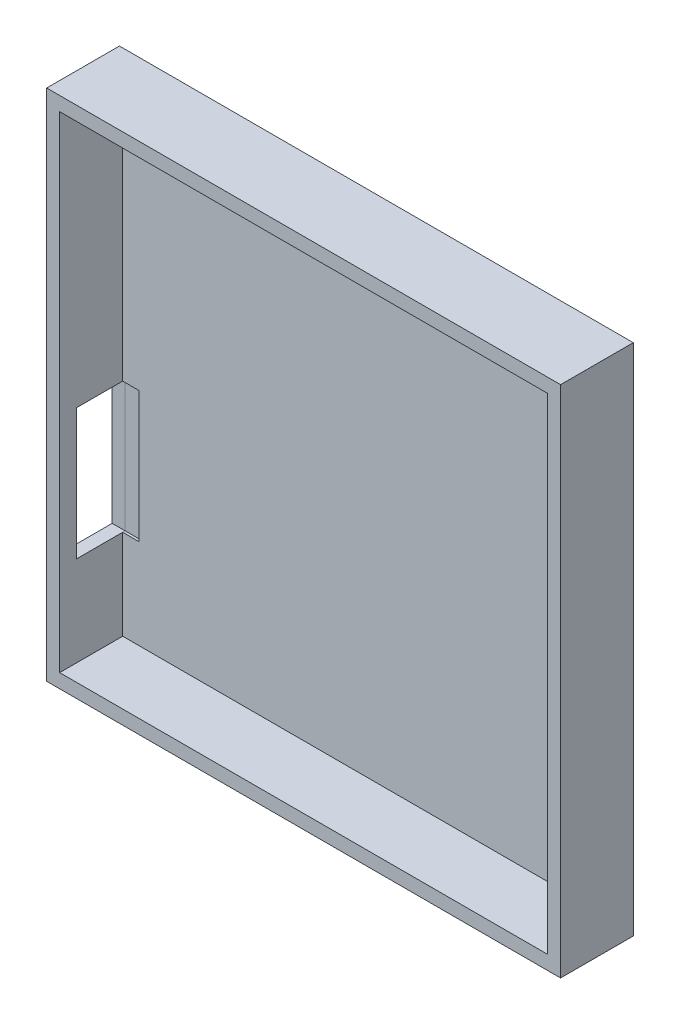
ISO-10303-21;
HEADER;
FILE_DESCRIPTION(('STEP AP214'),'2;1');
FILE_NAME('part.step','',(''),(''),'','','');
FILE_SCHEMA(('AUTOMOTIVE_DESIGN { 1 0 10303 214 1 1 1 1 }'));
ENDSEC;
DATA;
#1=APPLICATION_CONTEXT('core data for automotive mechanical design processes');
#2=APPLICATION_PROTOCOL_DEFINITION('international standard','automotive_design',2000,#1);
#3=PRODUCT_CONTEXT('',#1,'mechanical');
#4=PRODUCT('Part','Part','',(#3));
#5=PRODUCT_RELATED_PRODUCT_CATEGORY('part','',(#4));
#6=PRODUCT_DEFINITION_FORMATION('','',#4);
#7=PRODUCT_DEFINITION_CONTEXT('part definition',#1,'design');
#8=PRODUCT_DEFINITION('design','',#6,#7);
#9=PRODUCT_DEFINITION_SHAPE('','',#8);
#10=(LENGTH_UNIT() NAMED_UNIT(*) SI_UNIT(.MILLI.,.METRE.));
#11=(NAMED_UNIT(*) PLANE_ANGLE_UNIT() SI_UNIT($,.RADIAN.));
#12=(NAMED_UNIT(*) SI_UNIT($,.STERADIAN.) SOLID_ANGLE_UNIT());
#13=UNCERTAINTY_MEASURE_WITH_UNIT(LENGTH_MEASURE(1.E-05),#10,'distance_accuracy_value','');
#14=(GEOMETRIC_REPRESENTATION_CONTEXT(3) GLOBAL_UNCERTAINTY_ASSIGNED_CONTEXT((#13)) GLOBAL_UNIT_ASSIGNED_CONTEXT((#10,
#11,#12)) REPRESENTATION_CONTEXT('',''));
#15=CARTESIAN_POINT('',(0.,0.,0.));
#16=DIRECTION('',(0.,0.,1.));
#17=DIRECTION('',(1.,0.,0.));
#18=AXIS2_PLACEMENT_3D('',#15,#16,#17);
#19=CARTESIAN_POINT('',(100.674181587413,-143.86005830323,2.));
#20=DIRECTION('',(-1.,0.,0.));
#21=DIRECTION('',(0.,0.,1.));
#22=AXIS2_PLACEMENT_3D('',#19,#20,#21);
#23=PLANE('',#22);
#24=DIRECTION('',(0.,0.,1.));
#25=VECTOR('',#24,1.);
#26=CARTESIAN_POINT('',(100.674181587413,-125.279102377652,2.));
#27=LINE('',#26,#25);
#28=CARTESIAN_POINT('',(100.674181587413,-125.279102377652,1.5));
#29=VERTEX_POINT('',#28);
#30=CARTESIAN_POINT('',(100.674181587413,-125.279102377652,2.));
#31=VERTEX_POINT('',#30);
#32=EDGE_CURVE('E150',#29,#31,#27,.T.);
#33=ORIENTED_EDGE('',*,*,#32,.F.);
#34=DIRECTION('',(0.,-1.,0.));
#35=VECTOR('',#34,1.);
#36=CARTESIAN_POINT('',(100.674181587413,-143.86005830323,1.50000000000001));
#37=LINE('',#36,#35);
#38=CARTESIAN_POINT('',(100.674181587413,-98.2791023776523,1.5));
#39=VERTEX_POINT('',#38);
#40=EDGE_CURVE('E12',#39,#29,#37,.T.);
#41=ORIENTED_EDGE('',*,*,#40,.F.);
#42=DIRECTION('',(0.,0.,1.));
#43=VECTOR('',#42,1.);
#44=CARTESIAN_POINT('',(100.674181587413,-98.2791023776523,2.));
#45=LINE('',#44,#43);
#46=CARTESIAN_POINT('',(100.674181587413,-98.2791023776523,2.));
#47=VERTEX_POINT('',#46);
#48=EDGE_CURVE('E127',#39,#47,#45,.T.);
#49=ORIENTED_EDGE('',*,*,#48,.T.);
#50=DIRECTION('',(0.,1.,0.));
#51=VECTOR('',#50,1.);
#52=CARTESIAN_POINT('',(100.674181587413,-143.86005830323,2.));
#53=LINE('',#52,#51);
#54=CARTESIAN_POINT('',(100.674181587413,-43.6399416967701,2.));
#55=VERTEX_POINT('',#54);
#56=EDGE_CURVE('E98',#47,#55,#53,.T.);
#57=ORIENTED_EDGE('',*,*,#56,.T.);
#58=DIRECTION('',(0.,0.,-1.));
#59=VECTOR('',#58,1.);
#60=CARTESIAN_POINT('',(100.674181587413,-43.6399416967701,2.));
#61=LINE('',#60,#59);
#62=CARTESIAN_POINT('',(100.674181587413,-43.6399416967701,0.));
#63=VERTEX_POINT('',#62);
#64=EDGE_CURVE('E167',#55,#63,#61,.T.);
#65=ORIENTED_EDGE('',*,*,#64,.T.);
#66=DIRECTION('',(0.,1.,0.));
#67=VECTOR('',#66,1.);
#68=CARTESIAN_POINT('',(100.674181587413,-143.86005830323,0.));
#69=LINE('',#68,#67);
#70=CARTESIAN_POINT('',(100.674181587413,-143.86005830323,0.));
#71=VERTEX_POINT('',#70);
#72=EDGE_CURVE('E153',#71,#63,#69,.T.);
#73=ORIENTED_EDGE('',*,*,#72,.F.);
#74=DIRECTION('',(0.,0.,-1.));
#75=VECTOR('',#74,1.);
#76=CARTESIAN_POINT('',(100.674181587413,-143.86005830323,2.));
#77=LINE('',#76,#75);
#78=CARTESIAN_POINT('',(100.674181587413,-143.86005830323,2.));
#79=VERTEX_POINT('',#78);
#80=EDGE_CURVE('E74',#79,#71,#77,.T.);
#81=ORIENTED_EDGE('',*,*,#80,.F.);
#82=EDGE_CURVE('E154',#79,#31,#53,.T.);
#83=ORIENTED_EDGE('',*,*,#82,.T.);
#84=EDGE_LOOP('',(#33,#41,#49,#57,#65,#73,#81,#83));
#85=FACE_BOUND('',#84,.T.);
#86=ADVANCED_FACE('F50',(#85),#23,.T.);
#87=CARTESIAN_POINT('',(100.674181587413,-143.86005830323,2.));
#88=DIRECTION('',(0.,1.,0.));
#89=DIRECTION('',(0.,0.,1.));
#90=AXIS2_PLACEMENT_3D('',#87,#88,#89);
#91=PLANE('',#90);
#92=DIRECTION('',(1.,0.,0.));
#93=VECTOR('',#92,1.);
#94=CARTESIAN_POINT('',(100.674181587413,-143.86005830323,0.));
#95=LINE('',#94,#93);
#96=CARTESIAN_POINT('',(201.333218412587,-143.86005830323,0.));
#97=VERTEX_POINT('',#96);
#98=EDGE_CURVE('E179',#71,#97,#95,.T.);
#99=ORIENTED_EDGE('',*,*,#98,.T.);
#100=DIRECTION('',(0.,0.,-1.));
#101=VECTOR('',#100,1.);
#102=CARTESIAN_POINT('',(201.333218412587,-143.86005830323,2.));
#103=LINE('',#102,#101);
#104=CARTESIAN_POINT('',(201.333218412587,-143.86005830323,2.));
#105=VERTEX_POINT('',#104);
#106=EDGE_CURVE('E184',#105,#97,#103,.T.);
#107=ORIENTED_EDGE('',*,*,#106,.F.);
#108=DIRECTION('',(1.,0.,0.));
#109=VECTOR('',#108,1.);
#110=CARTESIAN_POINT('',(100.674181587413,-143.86005830323,2.));
#111=LINE('',#110,#109);
#112=EDGE_CURVE('E164',#79,#105,#111,.T.);
#113=ORIENTED_EDGE('',*,*,#112,.F.);
#114=ORIENTED_EDGE('',*,*,#80,.T.);
#115=EDGE_LOOP('',(#99,#107,#113,#114));
#116=FACE_BOUND('',#115,.T.);
#117=ADVANCED_FACE('F218',(#116),#91,.F.);
#118=CARTESIAN_POINT('',(201.333218412587,-143.86005830323,2.));
#119=DIRECTION('',(-1.,0.,0.));
#120=DIRECTION('',(0.,0.,1.));
#121=AXIS2_PLACEMENT_3D('',#118,#119,#120);
#122=PLANE('',#121);
#123=DIRECTION('',(0.,1.,0.));
#124=VECTOR('',#123,1.);
#125=CARTESIAN_POINT('',(201.333218412587,-143.86005830323,0.));
#126=LINE('',#125,#124);
#127=CARTESIAN_POINT('',(201.333218412587,-43.6399416967701,0.));
#128=VERTEX_POINT('',#127);
#129=EDGE_CURVE('E175',#97,#128,#126,.T.);
#130=ORIENTED_EDGE('',*,*,#129,.T.);
#131=DIRECTION('',(0.,0.,-1.));
#132=VECTOR('',#131,1.);
#133=CARTESIAN_POINT('',(201.333218412587,-43.6399416967701,2.));
#134=LINE('',#133,#132);
#135=CARTESIAN_POINT('',(201.333218412587,-43.6399416967701,2.));
#136=VERTEX_POINT('',#135);
#137=EDGE_CURVE('E188',#136,#128,#134,.T.);
#138=ORIENTED_EDGE('',*,*,#137,.F.);
#139=DIRECTION('',(0.,1.,0.));
#140=VECTOR('',#139,1.);
#141=CARTESIAN_POINT('',(201.333218412587,-143.86005830323,2.));
#142=LINE('',#141,#140);
#143=EDGE_CURVE('E161',#105,#136,#142,.T.);
#144=ORIENTED_EDGE('',*,*,#143,.F.);
#145=ORIENTED_EDGE('',*,*,#106,.T.);
#146=EDGE_LOOP('',(#130,#138,#144,#145));
#147=FACE_BOUND('',#146,.T.);
#148=ADVANCED_FACE('F224',(#147),#122,.F.);
#149=CARTESIAN_POINT('',(100.674181587413,-43.6399416967701,2.));
#150=DIRECTION('',(0.,1.,0.));
#151=DIRECTION('',(0.,0.,1.));
#152=AXIS2_PLACEMENT_3D('',#149,#150,#151);
#153=PLANE('',#152);
#154=DIRECTION('',(1.,0.,0.));
#155=VECTOR('',#154,1.);
#156=CARTESIAN_POINT('',(100.674181587413,-43.6399416967701,0.));
#157=LINE('',#156,#155);
#158=EDGE_CURVE('E171',#63,#128,#157,.T.);
#159=ORIENTED_EDGE('',*,*,#158,.F.);
#160=ORIENTED_EDGE('',*,*,#64,.F.);
#161=DIRECTION('',(1.,0.,0.));
#162=VECTOR('',#161,1.);
#163=CARTESIAN_POINT('',(100.674181587413,-43.6399416967701,2.));
#164=LINE('',#163,#162);
#165=EDGE_CURVE('E157',#55,#136,#164,.T.);
#166=ORIENTED_EDGE('',*,*,#165,.T.);
#167=ORIENTED_EDGE('',*,*,#137,.T.);
#168=EDGE_LOOP('',(#159,#160,#166,#167));
#169=FACE_BOUND('',#168,.T.);
#170=ADVANCED_FACE('F229',(#169),#153,.T.);
#171=CARTESIAN_POINT('',(0.,0.,2.));
#172=DIRECTION('',(0.,0.,-1.));
#173=DIRECTION('',(-1.,0.,0.));
#174=AXIS2_PLACEMENT_3D('',#171,#172,#173);
#175=PLANE('',#174);
#176=DIRECTION('',(0.,-1.,0.));
#177=VECTOR('',#176,1.);
#178=CARTESIAN_POINT('',(104.0037,0.,2.));
#179=LINE('',#178,#177);
#180=CARTESIAN_POINT('',(104.0037,-98.2791023776523,2.));
#181=VERTEX_POINT('',#180);
#182=CARTESIAN_POINT('',(104.0037,-125.279102377652,2.));
#183=VERTEX_POINT('',#182);
#184=EDGE_CURVE('E137',#181,#183,#179,.T.);
#185=ORIENTED_EDGE('',*,*,#184,.T.);
#186=DIRECTION('',(-1.,0.,0.));
#187=VECTOR('',#186,1.);
#188=CARTESIAN_POINT('',(0.,-125.279102377652,2.));
#189=LINE('',#188,#187);
#190=EDGE_CURVE('E58',#183,#31,#189,.T.);
#191=ORIENTED_EDGE('',*,*,#190,.T.);
#192=ORIENTED_EDGE('',*,*,#82,.F.);
#193=ORIENTED_EDGE('',*,*,#112,.T.);
#194=ORIENTED_EDGE('',*,*,#143,.T.);
#195=ORIENTED_EDGE('',*,*,#165,.F.);
#196=ORIENTED_EDGE('',*,*,#56,.F.);
#197=DIRECTION('',(-1.,0.,0.));
#198=VECTOR('',#197,1.);
#199=CARTESIAN_POINT('',(0.,-98.2791023776523,2.));
#200=LINE('',#199,#198);
#201=EDGE_CURVE('E195',#181,#47,#200,.T.);
#202=ORIENTED_EDGE('',*,*,#201,.F.);
#203=EDGE_LOOP('',(#185,#191,#192,#193,#194,#195,#196,#202));
#204=FACE_BOUND('',#203,.T.);
#205=ADVANCED_FACE('F201',(#204),#175,.F.);
#206=CARTESIAN_POINT('',(0.,0.,0.));
#207=DIRECTION('',(0.,0.,-1.));
#208=DIRECTION('',(-1.,0.,0.));
#209=AXIS2_PLACEMENT_3D('',#206,#207,#208);
#210=PLANE('',#209);
#211=ORIENTED_EDGE('',*,*,#72,.T.);
#212=ORIENTED_EDGE('',*,*,#158,.T.);
#213=ORIENTED_EDGE('',*,*,#129,.F.);
#214=ORIENTED_EDGE('',*,*,#98,.F.);
#215=EDGE_LOOP('',(#211,#212,#213,#214));
#216=FACE_BOUND('',#215,.T.);
#217=ADVANCED_FACE('F213',(#216),#210,.T.);
#218=CARTESIAN_POINT('',(104.0037,0.,0.));
#219=DIRECTION('',(1.,0.,0.));
#220=DIRECTION('',(0.,0.,-1.));
#221=AXIS2_PLACEMENT_3D('',#218,#219,#220);
#222=PLANE('',#221);
#223=DIRECTION('',(0.,0.,1.));
#224=VECTOR('',#223,1.);
#225=CARTESIAN_POINT('',(104.0037,-98.2791023776523,1.5));
#226=LINE('',#225,#224);
#227=CARTESIAN_POINT('',(104.0037,-98.2791023776523,1.5));
#228=VERTEX_POINT('',#227);
#229=EDGE_CURVE('E125',#228,#181,#226,.T.);
#230=ORIENTED_EDGE('',*,*,#229,.F.);
#231=DIRECTION('',(0.,-1.,0.));
#232=VECTOR('',#231,1.);
#233=CARTESIAN_POINT('',(104.0037,-98.2791023776523,1.5));
#234=LINE('',#233,#232);
#235=CARTESIAN_POINT('',(104.0037,-125.279102377652,1.5));
#236=VERTEX_POINT('',#235);
#237=EDGE_CURVE('E133',#228,#236,#234,.T.);
#238=ORIENTED_EDGE('',*,*,#237,.T.);
#239=DIRECTION('',(0.,0.,1.));
#240=VECTOR('',#239,1.);
#241=CARTESIAN_POINT('',(104.0037,-125.279102377652,1.5));
#242=LINE('',#241,#240);
#243=EDGE_CURVE('E65',#236,#183,#242,.T.);
#244=ORIENTED_EDGE('',*,*,#243,.T.);
#245=ORIENTED_EDGE('',*,*,#184,.F.);
#246=EDGE_LOOP('',(#230,#238,#244,#245));
#247=FACE_BOUND('',#246,.T.);
#248=ADVANCED_FACE('F135',(#247),#222,.F.);
#249=CARTESIAN_POINT('',(104.0037,-125.279102377652,1.5));
#250=DIRECTION('',(0.,-1.,0.));
#251=DIRECTION('',(0.,0.,-1.));
#252=AXIS2_PLACEMENT_3D('',#249,#250,#251);
#253=PLANE('',#252);
#254=ORIENTED_EDGE('',*,*,#32,.T.);
#255=ORIENTED_EDGE('',*,*,#190,.F.);
#256=ORIENTED_EDGE('',*,*,#243,.F.);
#257=DIRECTION('',(-1.,0.,0.));
#258=VECTOR('',#257,1.);
#259=CARTESIAN_POINT('',(104.0037,-125.279102377652,1.5));
#260=LINE('',#259,#258);
#261=EDGE_CURVE('E132',#236,#29,#260,.T.);
#262=ORIENTED_EDGE('',*,*,#261,.T.);
#263=EDGE_LOOP('',(#254,#255,#256,#262));
#264=FACE_BOUND('',#263,.T.);
#265=ADVANCED_FACE('F204',(#264),#253,.F.);
#266=CARTESIAN_POINT('',(104.0037,-98.2791023776523,1.5));
#267=DIRECTION('',(0.,0.,-1.));
#268=DIRECTION('',(0.,1.,0.));
#269=AXIS2_PLACEMENT_3D('',#266,#267,#268);
#270=PLANE('',#269);
#271=ORIENTED_EDGE('',*,*,#40,.T.);
#272=ORIENTED_EDGE('',*,*,#261,.F.);
#273=ORIENTED_EDGE('',*,*,#237,.F.);
#274=DIRECTION('',(-1.,0.,0.));
#275=VECTOR('',#274,1.);
#276=CARTESIAN_POINT('',(104.0037,-98.2791023776523,1.5));
#277=LINE('',#276,#275);
#278=EDGE_CURVE('E122',#228,#39,#277,.T.);
#279=ORIENTED_EDGE('',*,*,#278,.T.);
#280=EDGE_LOOP('',(#271,#272,#273,#279));
#281=FACE_BOUND('',#280,.T.);
#282=ADVANCED_FACE('F140',(#281),#270,.F.);
#283=CARTESIAN_POINT('',(104.0037,-98.2791023776523,1.5));
#284=DIRECTION('',(0.,-1.,0.));
#285=DIRECTION('',(0.,0.,-1.));
#286=AXIS2_PLACEMENT_3D('',#283,#284,#285);
#287=PLANE('',#286);
#288=ORIENTED_EDGE('',*,*,#278,.F.);
#289=ORIENTED_EDGE('',*,*,#229,.T.);
#290=ORIENTED_EDGE('',*,*,#201,.T.);
#291=ORIENTED_EDGE('',*,*,#48,.F.);
#292=EDGE_LOOP('',(#288,#289,#290,#291));
#293=FACE_BOUND('',#292,.T.);
#294=ADVANCED_FACE('F124',(#293),#287,.T.);
#295=CLOSED_SHELL('',(#86,#117,#148,#170,#205,#217,#248,#265,#282,#294));
#296=MANIFOLD_SOLID_BREP('B2',#295);
#297=CARTESIAN_POINT('',(0.,0.,15.));
#298=DIRECTION('',(0.,0.,-1.));
#299=DIRECTION('',(-1.,0.,0.));
#300=AXIS2_PLACEMENT_3D('',#297,#298,#299);
#301=PLANE('',#300);
#302=DIRECTION('',(0.,-1.,0.));
#303=VECTOR('',#302,1.);
#304=CARTESIAN_POINT('',(98.0037,-146.75,15.));
#305=LINE('',#304,#303);
#306=CARTESIAN_POINT('',(98.0037,-40.75,15.));
#307=VERTEX_POINT('',#306);
#308=CARTESIAN_POINT('',(98.0037,-146.75,15.));
#309=VERTEX_POINT('',#308);
#310=EDGE_CURVE('E448',#307,#309,#305,.T.);
#311=ORIENTED_EDGE('',*,*,#310,.T.);
#312=DIRECTION('',(1.,0.,0.));
#313=VECTOR('',#312,1.);
#314=CARTESIAN_POINT('',(98.0037,-146.75,15.));
#315=LINE('',#314,#313);
#316=CARTESIAN_POINT('',(204.0037,-146.75,15.));
#317=VERTEX_POINT('',#316);
#318=EDGE_CURVE('E451',#309,#317,#315,.T.);
#319=ORIENTED_EDGE('',*,*,#318,.T.);
#320=DIRECTION('',(0.,1.,0.));
#321=VECTOR('',#320,1.);
#322=CARTESIAN_POINT('',(204.0037,-146.75,15.));
#323=LINE('',#322,#321);
#324=CARTESIAN_POINT('',(204.0037,-40.75,15.));
#325=VERTEX_POINT('',#324);
#326=EDGE_CURVE('E454',#317,#325,#323,.T.);
#327=ORIENTED_EDGE('',*,*,#326,.T.);
#328=DIRECTION('',(-1.,0.,0.));
#329=VECTOR('',#328,1.);
#330=CARTESIAN_POINT('',(98.0037,-40.75,15.));
#331=LINE('',#330,#329);
#332=EDGE_CURVE('E456',#325,#307,#331,.T.);
#333=ORIENTED_EDGE('',*,*,#332,.T.);
#334=EDGE_LOOP('',(#311,#319,#327,#333));
#335=FACE_BOUND('',#334,.T.);
#336=DIRECTION('',(-1.,0.,0.));
#337=VECTOR('',#336,1.);
#338=CARTESIAN_POINT('',(100.674181587413,-43.6399416967701,15.));
#339=LINE('',#338,#337);
#340=CARTESIAN_POINT('',(201.333218412587,-43.6399416967701,15.));
#341=VERTEX_POINT('',#340);
#342=CARTESIAN_POINT('',(100.674181587413,-43.6399416967701,15.));
#343=VERTEX_POINT('',#342);
#344=EDGE_CURVE('E417',#341,#343,#339,.T.);
#345=ORIENTED_EDGE('',*,*,#344,.F.);
#346=DIRECTION('',(0.,1.,0.));
#347=VECTOR('',#346,1.);
#348=CARTESIAN_POINT('',(201.333218412587,-143.86005830323,15.));
#349=LINE('',#348,#347);
#350=CARTESIAN_POINT('',(201.333218412587,-143.86005830323,15.));
#351=VERTEX_POINT('',#350);
#352=EDGE_CURVE('E425',#351,#341,#349,.T.);
#353=ORIENTED_EDGE('',*,*,#352,.F.);
#354=DIRECTION('',(1.,0.,0.));
#355=VECTOR('',#354,1.);
#356=CARTESIAN_POINT('',(100.674181587413,-143.86005830323,15.));
#357=LINE('',#356,#355);
#358=CARTESIAN_POINT('',(100.674181587413,-143.86005830323,15.));
#359=VERTEX_POINT('',#358);
#360=EDGE_CURVE('E422',#359,#351,#357,.T.);
#361=ORIENTED_EDGE('',*,*,#360,.F.);
#362=DIRECTION('',(0.,-1.,0.));
#363=VECTOR('',#362,1.);
#364=CARTESIAN_POINT('',(100.674181587413,-143.86005830323,15.));
#365=LINE('',#364,#363);
#366=EDGE_CURVE('E419',#343,#359,#365,.T.);
#367=ORIENTED_EDGE('',*,*,#366,.F.);
#368=EDGE_LOOP('',(#345,#353,#361,#367));
#369=FACE_BOUND('',#368,.T.);
#370=ADVANCED_FACE('F301',(#335,#369),#301,.F.);
#371=CARTESIAN_POINT('',(0.,0.,0.));
#372=DIRECTION('',(0.,0.,-1.));
#373=DIRECTION('',(-1.,0.,0.));
#374=AXIS2_PLACEMENT_3D('',#371,#372,#373);
#375=PLANE('',#374);
#376=DIRECTION('',(0.,-1.,0.));
#377=VECTOR('',#376,1.);
#378=CARTESIAN_POINT('',(98.0037,-146.75,0.));
#379=LINE('',#378,#377);
#380=CARTESIAN_POINT('',(98.0037,-40.75,0.));
#381=VERTEX_POINT('',#380);
#382=CARTESIAN_POINT('',(98.0037,-146.75,0.));
#383=VERTEX_POINT('',#382);
#384=EDGE_CURVE('E447',#381,#383,#379,.T.);
#385=ORIENTED_EDGE('',*,*,#384,.F.);
#386=DIRECTION('',(-1.,0.,0.));
#387=VECTOR('',#386,1.);
#388=CARTESIAN_POINT('',(98.0037,-40.75,0.));
#389=LINE('',#388,#387);
#390=CARTESIAN_POINT('',(204.0037,-40.75,0.));
#391=VERTEX_POINT('',#390);
#392=EDGE_CURVE('E452',#391,#381,#389,.T.);
#393=ORIENTED_EDGE('',*,*,#392,.F.);
#394=DIRECTION('',(0.,1.,0.));
#395=VECTOR('',#394,1.);
#396=CARTESIAN_POINT('',(204.0037,-146.75,0.));
#397=LINE('',#396,#395);
#398=CARTESIAN_POINT('',(204.0037,-146.75,0.));
#399=VERTEX_POINT('',#398);
#400=EDGE_CURVE('E463',#399,#391,#397,.T.);
#401=ORIENTED_EDGE('',*,*,#400,.F.);
#402=DIRECTION('',(1.,0.,0.));
#403=VECTOR('',#402,1.);
#404=CARTESIAN_POINT('',(98.0037,-146.75,0.));
#405=LINE('',#404,#403);
#406=EDGE_CURVE('E461',#383,#399,#405,.T.);
#407=ORIENTED_EDGE('',*,*,#406,.F.);
#408=EDGE_LOOP('',(#385,#393,#401,#407));
#409=FACE_BOUND('',#408,.T.);
#410=DIRECTION('',(0.,1.,0.));
#411=VECTOR('',#410,1.);
#412=CARTESIAN_POINT('',(201.333218412587,-143.86005830323,0.));
#413=LINE('',#412,#411);
#414=CARTESIAN_POINT('',(201.333218412587,-143.86005830323,0.));
#415=VERTEX_POINT('',#414);
#416=CARTESIAN_POINT('',(201.333218412587,-43.6399416967701,0.));
#417=VERTEX_POINT('',#416);
#418=EDGE_CURVE('E420',#415,#417,#413,.T.);
#419=ORIENTED_EDGE('',*,*,#418,.T.);
#420=DIRECTION('',(-1.,0.,0.));
#421=VECTOR('',#420,1.);
#422=CARTESIAN_POINT('',(100.674181587413,-43.6399416967701,0.));
#423=LINE('',#422,#421);
#424=CARTESIAN_POINT('',(100.674181587413,-43.6399416967701,0.));
#425=VERTEX_POINT('',#424);
#426=EDGE_CURVE('E414',#417,#425,#423,.T.);
#427=ORIENTED_EDGE('',*,*,#426,.T.);
#428=DIRECTION('',(0.,-1.,0.));
#429=VECTOR('',#428,1.);
#430=CARTESIAN_POINT('',(100.674181587413,-143.86005830323,0.));
#431=LINE('',#430,#429);
#432=CARTESIAN_POINT('',(100.674181587413,-143.86005830323,0.));
#433=VERTEX_POINT('',#432);
#434=EDGE_CURVE('E430',#425,#433,#431,.T.);
#435=ORIENTED_EDGE('',*,*,#434,.T.);
#436=DIRECTION('',(1.,0.,0.));
#437=VECTOR('',#436,1.);
#438=CARTESIAN_POINT('',(100.674181587413,-143.86005830323,0.));
#439=LINE('',#438,#437);
#440=EDGE_CURVE('E433',#433,#415,#439,.T.);
#441=ORIENTED_EDGE('',*,*,#440,.T.);
#442=EDGE_LOOP('',(#419,#427,#435,#441));
#443=FACE_BOUND('',#442,.T.);
#444=ADVANCED_FACE('F501',(#409,#443),#375,.T.);
#445=CARTESIAN_POINT('',(98.0037,-146.75,15.));
#446=DIRECTION('',(1.,0.,0.));
#447=DIRECTION('',(0.,0.,-1.));
#448=AXIS2_PLACEMENT_3D('',#445,#446,#447);
#449=PLANE('',#448);
#450=DIRECTION('',(0.,-1.,0.));
#451=VECTOR('',#450,1.);
#452=CARTESIAN_POINT('',(98.0037,-98.2791023776523,11.5));
#453=LINE('',#452,#451);
#454=CARTESIAN_POINT('',(98.0037,-98.2791023776523,11.5));
#455=VERTEX_POINT('',#454);
#456=CARTESIAN_POINT('',(98.0037,-125.279102377652,11.5));
#457=VERTEX_POINT('',#456);
#458=EDGE_CURVE('E401',#455,#457,#453,.T.);
#459=ORIENTED_EDGE('',*,*,#458,.T.);
#460=DIRECTION('',(0.,0.,1.));
#461=VECTOR('',#460,1.);
#462=CARTESIAN_POINT('',(98.0037,-125.279102377652,1.5));
#463=LINE('',#462,#461);
#464=CARTESIAN_POINT('',(98.0037,-125.279102377652,1.5));
#465=VERTEX_POINT('',#464);
#466=EDGE_CURVE('E316',#465,#457,#463,.T.);
#467=ORIENTED_EDGE('',*,*,#466,.F.);
#468=DIRECTION('',(0.,-1.,0.));
#469=VECTOR('',#468,1.);
#470=CARTESIAN_POINT('',(98.0037,-98.2791023776523,1.5));
#471=LINE('',#470,#469);
#472=CARTESIAN_POINT('',(98.0037,-98.2791023776523,1.5));
#473=VERTEX_POINT('',#472);
#474=EDGE_CURVE('E407',#473,#465,#471,.T.);
#475=ORIENTED_EDGE('',*,*,#474,.F.);
#476=DIRECTION('',(0.,0.,1.));
#477=VECTOR('',#476,1.);
#478=CARTESIAN_POINT('',(98.0037,-98.2791023776523,1.5));
#479=LINE('',#478,#477);
#480=EDGE_CURVE('E392',#473,#455,#479,.T.);
#481=ORIENTED_EDGE('',*,*,#480,.T.);
#482=EDGE_LOOP('',(#459,#467,#475,#481));
#483=FACE_BOUND('',#482,.T.);
#484=ORIENTED_EDGE('',*,*,#384,.T.);
#485=DIRECTION('',(0.,0.,-1.));
#486=VECTOR('',#485,1.);
#487=CARTESIAN_POINT('',(98.0037,-146.75,15.));
#488=LINE('',#487,#486);
#489=EDGE_CURVE('E474',#309,#383,#488,.T.);
#490=ORIENTED_EDGE('',*,*,#489,.F.);
#491=ORIENTED_EDGE('',*,*,#310,.F.);
#492=DIRECTION('',(0.,0.,-1.));
#493=VECTOR('',#492,1.);
#494=CARTESIAN_POINT('',(98.0037,-40.75,15.));
#495=LINE('',#494,#493);
#496=EDGE_CURVE('E458',#307,#381,#495,.T.);
#497=ORIENTED_EDGE('',*,*,#496,.T.);
#498=EDGE_LOOP('',(#484,#490,#491,#497));
#499=FACE_BOUND('',#498,.T.);
#500=ADVANCED_FACE('F303',(#483,#499),#449,.F.);
#501=CARTESIAN_POINT('',(98.0037,-146.75,15.));
#502=DIRECTION('',(0.,1.,0.));
#503=DIRECTION('',(0.,0.,1.));
#504=AXIS2_PLACEMENT_3D('',#501,#502,#503);
#505=PLANE('',#504);
#506=ORIENTED_EDGE('',*,*,#406,.T.);
#507=DIRECTION('',(0.,0.,-1.));
#508=VECTOR('',#507,1.);
#509=CARTESIAN_POINT('',(204.0037,-146.75,15.));
#510=LINE('',#509,#508);
#511=EDGE_CURVE('E471',#317,#399,#510,.T.);
#512=ORIENTED_EDGE('',*,*,#511,.F.);
#513=ORIENTED_EDGE('',*,*,#318,.F.);
#514=ORIENTED_EDGE('',*,*,#489,.T.);
#515=EDGE_LOOP('',(#506,#512,#513,#514));
#516=FACE_BOUND('',#515,.T.);
#517=ADVANCED_FACE('F520',(#516),#505,.F.);
#518=CARTESIAN_POINT('',(204.0037,-146.75,15.));
#519=DIRECTION('',(-1.,0.,0.));
#520=DIRECTION('',(0.,0.,1.));
#521=AXIS2_PLACEMENT_3D('',#518,#519,#520);
#522=PLANE('',#521);
#523=ORIENTED_EDGE('',*,*,#400,.T.);
#524=DIRECTION('',(0.,0.,-1.));
#525=VECTOR('',#524,1.);
#526=CARTESIAN_POINT('',(204.0037,-40.75,15.));
#527=LINE('',#526,#525);
#528=EDGE_CURVE('E468',#325,#391,#527,.T.);
#529=ORIENTED_EDGE('',*,*,#528,.F.);
#530=ORIENTED_EDGE('',*,*,#326,.F.);
#531=ORIENTED_EDGE('',*,*,#511,.T.);
#532=EDGE_LOOP('',(#523,#529,#530,#531));
#533=FACE_BOUND('',#532,.T.);
#534=ADVANCED_FACE('F517',(#533),#522,.F.);
#535=CARTESIAN_POINT('',(98.0037,-40.75,15.));
#536=DIRECTION('',(0.,-1.,0.));
#537=DIRECTION('',(0.,0.,-1.));
#538=AXIS2_PLACEMENT_3D('',#535,#536,#537);
#539=PLANE('',#538);
#540=ORIENTED_EDGE('',*,*,#392,.T.);
#541=ORIENTED_EDGE('',*,*,#496,.F.);
#542=ORIENTED_EDGE('',*,*,#332,.F.);
#543=ORIENTED_EDGE('',*,*,#528,.T.);
#544=EDGE_LOOP('',(#540,#541,#542,#543));
#545=FACE_BOUND('',#544,.T.);
#546=ADVANCED_FACE('F514',(#545),#539,.F.);
#547=CARTESIAN_POINT('',(100.674181587413,-43.6399416967701,15.));
#548=DIRECTION('',(0.,-1.,0.));
#549=DIRECTION('',(0.,0.,-1.));
#550=AXIS2_PLACEMENT_3D('',#547,#548,#549);
#551=PLANE('',#550);
#552=ORIENTED_EDGE('',*,*,#426,.F.);
#553=DIRECTION('',(0.,0.,-1.));
#554=VECTOR('',#553,1.);
#555=CARTESIAN_POINT('',(201.333218412587,-43.6399416967701,15.));
#556=LINE('',#555,#554);
#557=EDGE_CURVE('E427',#341,#417,#556,.T.);
#558=ORIENTED_EDGE('',*,*,#557,.F.);
#559=ORIENTED_EDGE('',*,*,#344,.T.);
#560=DIRECTION('',(0.,0.,-1.));
#561=VECTOR('',#560,1.);
#562=CARTESIAN_POINT('',(100.674181587413,-43.6399416967701,15.));
#563=LINE('',#562,#561);
#564=EDGE_CURVE('E444',#343,#425,#563,.T.);
#565=ORIENTED_EDGE('',*,*,#564,.T.);
#566=EDGE_LOOP('',(#552,#558,#559,#565));
#567=FACE_BOUND('',#566,.T.);
#568=ADVANCED_FACE('F511',(#567),#551,.T.);
#569=CARTESIAN_POINT('',(100.674181587413,-143.86005830323,15.));
#570=DIRECTION('',(1.,0.,0.));
#571=DIRECTION('',(0.,0.,-1.));
#572=AXIS2_PLACEMENT_3D('',#569,#570,#571);
#573=PLANE('',#572);
#574=DIRECTION('',(0.,0.,-1.));
#575=VECTOR('',#574,1.);
#576=CARTESIAN_POINT('',(100.674181587413,-125.279102377652,15.));
#577=LINE('',#576,#575);
#578=CARTESIAN_POINT('',(100.674181587413,-125.279102377652,11.5));
#579=VERTEX_POINT('',#578);
#580=CARTESIAN_POINT('',(100.674181587413,-125.279102377652,1.5));
#581=VERTEX_POINT('',#580);
#582=EDGE_CURVE('E48',#579,#581,#577,.T.);
#583=ORIENTED_EDGE('',*,*,#582,.F.);
#584=DIRECTION('',(0.,1.,0.));
#585=VECTOR('',#584,1.);
#586=CARTESIAN_POINT('',(100.674181587413,-143.86005830323,11.5));
#587=LINE('',#586,#585);
#588=CARTESIAN_POINT('',(100.674181587413,-98.2791023776523,11.5));
#589=VERTEX_POINT('',#588);
#590=EDGE_CURVE('E477',#579,#589,#587,.T.);
#591=ORIENTED_EDGE('',*,*,#590,.T.);
#592=DIRECTION('',(0.,0.,-1.));
#593=VECTOR('',#592,1.);
#594=CARTESIAN_POINT('',(100.674181587413,-98.2791023776523,15.));
#595=LINE('',#594,#593);
#596=CARTESIAN_POINT('',(100.674181587413,-98.2791023776523,1.5));
#597=VERTEX_POINT('',#596);
#598=EDGE_CURVE('E395',#589,#597,#595,.T.);
#599=ORIENTED_EDGE('',*,*,#598,.T.);
#600=DIRECTION('',(0.,1.,0.));
#601=VECTOR('',#600,1.);
#602=CARTESIAN_POINT('',(100.674181587413,-143.86005830323,1.5));
#603=LINE('',#602,#601);
#604=EDGE_CURVE('E309',#581,#597,#603,.T.);
#605=ORIENTED_EDGE('',*,*,#604,.F.);
#606=EDGE_LOOP('',(#583,#591,#599,#605));
#607=FACE_BOUND('',#606,.T.);
#608=ORIENTED_EDGE('',*,*,#434,.F.);
#609=ORIENTED_EDGE('',*,*,#564,.F.);
#610=ORIENTED_EDGE('',*,*,#366,.T.);
#611=DIRECTION('',(0.,0.,-1.));
#612=VECTOR('',#611,1.);
#613=CARTESIAN_POINT('',(100.674181587413,-143.86005830323,15.));
#614=LINE('',#613,#612);
#615=EDGE_CURVE('E442',#359,#433,#614,.T.);
#616=ORIENTED_EDGE('',*,*,#615,.T.);
#617=EDGE_LOOP('',(#608,#609,#610,#616));
#618=FACE_BOUND('',#617,.T.);
#619=ADVANCED_FACE('F485',(#607,#618),#573,.T.);
#620=CARTESIAN_POINT('',(100.674181587413,-143.86005830323,15.));
#621=DIRECTION('',(0.,1.,0.));
#622=DIRECTION('',(0.,0.,1.));
#623=AXIS2_PLACEMENT_3D('',#620,#621,#622);
#624=PLANE('',#623);
#625=ORIENTED_EDGE('',*,*,#440,.F.);
#626=ORIENTED_EDGE('',*,*,#615,.F.);
#627=ORIENTED_EDGE('',*,*,#360,.T.);
#628=DIRECTION('',(0.,0.,-1.));
#629=VECTOR('',#628,1.);
#630=CARTESIAN_POINT('',(201.333218412587,-143.86005830323,15.));
#631=LINE('',#630,#629);
#632=EDGE_CURVE('E440',#351,#415,#631,.T.);
#633=ORIENTED_EDGE('',*,*,#632,.T.);
#634=EDGE_LOOP('',(#625,#626,#627,#633));
#635=FACE_BOUND('',#634,.T.);
#636=ADVANCED_FACE('F496',(#635),#624,.T.);
#637=CARTESIAN_POINT('',(201.333218412587,-143.86005830323,15.));
#638=DIRECTION('',(-1.,0.,0.));
#639=DIRECTION('',(0.,0.,1.));
#640=AXIS2_PLACEMENT_3D('',#637,#638,#639);
#641=PLANE('',#640);
#642=ORIENTED_EDGE('',*,*,#418,.F.);
#643=ORIENTED_EDGE('',*,*,#632,.F.);
#644=ORIENTED_EDGE('',*,*,#352,.T.);
#645=ORIENTED_EDGE('',*,*,#557,.T.);
#646=EDGE_LOOP('',(#642,#643,#644,#645));
#647=FACE_BOUND('',#646,.T.);
#648=ADVANCED_FACE('F489',(#647),#641,.T.);
#649=CARTESIAN_POINT('',(104.0037,-125.279102377652,1.5));
#650=DIRECTION('',(0.,-1.,0.));
#651=DIRECTION('',(0.,0.,-1.));
#652=AXIS2_PLACEMENT_3D('',#649,#650,#651);
#653=PLANE('',#652);
#654=ORIENTED_EDGE('',*,*,#582,.T.);
#655=DIRECTION('',(-1.,0.,0.));
#656=VECTOR('',#655,1.);
#657=CARTESIAN_POINT('',(104.0037,-125.279102377652,1.5));
#658=LINE('',#657,#656);
#659=EDGE_CURVE('E412',#581,#465,#658,.T.);
#660=ORIENTED_EDGE('',*,*,#659,.T.);
#661=ORIENTED_EDGE('',*,*,#466,.T.);
#662=DIRECTION('',(-1.,0.,0.));
#663=VECTOR('',#662,1.);
#664=CARTESIAN_POINT('',(104.0037,-125.279102377652,11.5));
#665=LINE('',#664,#663);
#666=EDGE_CURVE('E398',#579,#457,#665,.T.);
#667=ORIENTED_EDGE('',*,*,#666,.F.);
#668=EDGE_LOOP('',(#654,#660,#661,#667));
#669=FACE_BOUND('',#668,.T.);
#670=ADVANCED_FACE('F487',(#669),#653,.F.);
#671=CARTESIAN_POINT('',(104.0037,-98.2791023776523,1.5));
#672=DIRECTION('',(0.,0.,-1.));
#673=DIRECTION('',(0.,1.,0.));
#674=AXIS2_PLACEMENT_3D('',#671,#672,#673);
#675=PLANE('',#674);
#676=ORIENTED_EDGE('',*,*,#604,.T.);
#677=DIRECTION('',(-1.,0.,0.));
#678=VECTOR('',#677,1.);
#679=CARTESIAN_POINT('',(104.0037,-98.2791023776523,1.5));
#680=LINE('',#679,#678);
#681=EDGE_CURVE('E397',#597,#473,#680,.T.);
#682=ORIENTED_EDGE('',*,*,#681,.T.);
#683=ORIENTED_EDGE('',*,*,#474,.T.);
#684=ORIENTED_EDGE('',*,*,#659,.F.);
#685=EDGE_LOOP('',(#676,#682,#683,#684));
#686=FACE_BOUND('',#685,.T.);
#687=ADVANCED_FACE('F482',(#686),#675,.F.);
#688=CARTESIAN_POINT('',(104.0037,-98.2791023776523,1.5));
#689=DIRECTION('',(0.,-1.,0.));
#690=DIRECTION('',(0.,0.,-1.));
#691=AXIS2_PLACEMENT_3D('',#688,#689,#690);
#692=PLANE('',#691);
#693=DIRECTION('',(-1.,0.,0.));
#694=VECTOR('',#693,1.);
#695=CARTESIAN_POINT('',(104.0037,-98.2791023776523,11.5));
#696=LINE('',#695,#694);
#697=EDGE_CURVE('E324',#589,#455,#696,.T.);
#698=ORIENTED_EDGE('',*,*,#697,.T.);
#699=ORIENTED_EDGE('',*,*,#480,.F.);
#700=ORIENTED_EDGE('',*,*,#681,.F.);
#701=ORIENTED_EDGE('',*,*,#598,.F.);
#702=EDGE_LOOP('',(#698,#699,#700,#701));
#703=FACE_BOUND('',#702,.T.);
#704=ADVANCED_FACE('F389',(#703),#692,.T.);
#705=CARTESIAN_POINT('',(104.0037,-98.2791023776523,11.5));
#706=DIRECTION('',(0.,0.,-1.));
#707=DIRECTION('',(0.,1.,0.));
#708=AXIS2_PLACEMENT_3D('',#705,#706,#707);
#709=PLANE('',#708);
#710=ORIENTED_EDGE('',*,*,#666,.T.);
#711=ORIENTED_EDGE('',*,*,#458,.F.);
#712=ORIENTED_EDGE('',*,*,#697,.F.);
#713=ORIENTED_EDGE('',*,*,#590,.F.);
#714=EDGE_LOOP('',(#710,#711,#712,#713));
#715=FACE_BOUND('',#714,.T.);
#716=ADVANCED_FACE('F402',(#715),#709,.T.);
#717=CLOSED_SHELL('',(#370,#444,#500,#517,#534,#546,#568,#619,#636,#648,#670,#687,#704,#716));
#718=MANIFOLD_SOLID_BREP('B6',#717);
#719=ADVANCED_BREP_SHAPE_REPRESENTATION('',(#18,#296,#718),#14);
#720=SHAPE_DEFINITION_REPRESENTATION(#9,#719);
ENDSEC;
END-ISO-10303-21;
